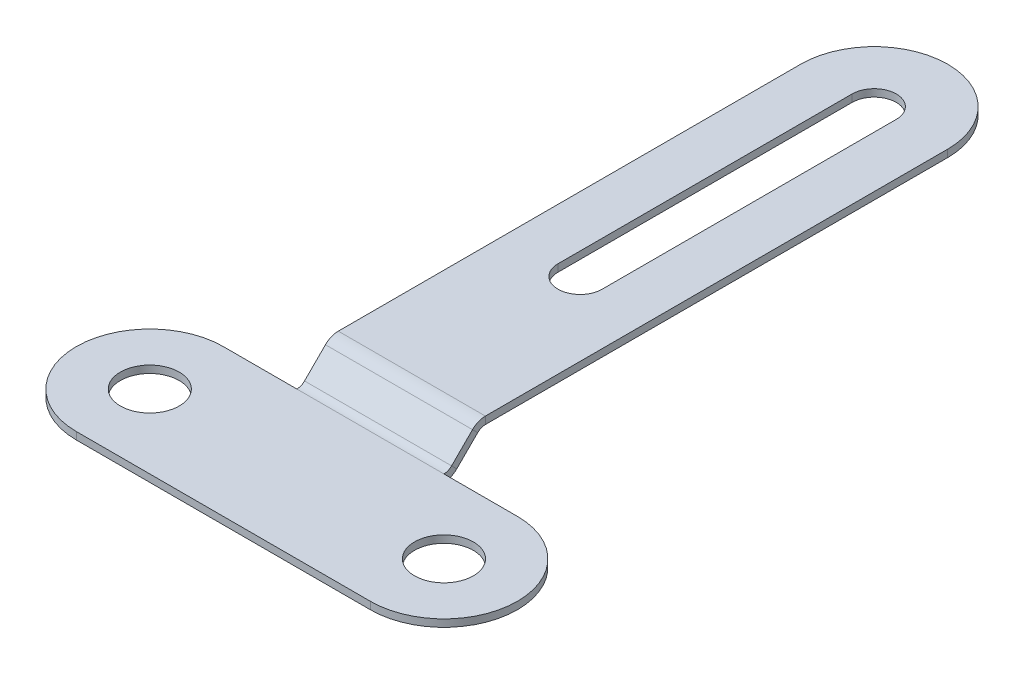
ISO-10303-21;
HEADER;
FILE_DESCRIPTION(('STEP AP214'),'2;1');
FILE_NAME('part.step','',(''),(''),'','','');
FILE_SCHEMA(('AUTOMOTIVE_DESIGN { 1 0 10303 214 1 1 1 1 }'));
ENDSEC;
DATA;
#1=APPLICATION_CONTEXT('core data for automotive mechanical design processes');
#2=APPLICATION_PROTOCOL_DEFINITION('international standard','automotive_design',2000,#1);
#3=PRODUCT_CONTEXT('',#1,'mechanical');
#4=PRODUCT('Part','Part','',(#3));
#5=PRODUCT_RELATED_PRODUCT_CATEGORY('part','',(#4));
#6=PRODUCT_DEFINITION_FORMATION('','',#4);
#7=PRODUCT_DEFINITION_CONTEXT('part definition',#1,'design');
#8=PRODUCT_DEFINITION('design','',#6,#7);
#9=PRODUCT_DEFINITION_SHAPE('','',#8);
#10=(LENGTH_UNIT() NAMED_UNIT(*) SI_UNIT(.MILLI.,.METRE.));
#11=(NAMED_UNIT(*) PLANE_ANGLE_UNIT() SI_UNIT($,.RADIAN.));
#12=(NAMED_UNIT(*) SI_UNIT($,.STERADIAN.) SOLID_ANGLE_UNIT());
#13=UNCERTAINTY_MEASURE_WITH_UNIT(LENGTH_MEASURE(1.E-05),#10,'distance_accuracy_value','');
#14=(GEOMETRIC_REPRESENTATION_CONTEXT(3) GLOBAL_UNCERTAINTY_ASSIGNED_CONTEXT((#13)) GLOBAL_UNIT_ASSIGNED_CONTEXT((#10,
#11,#12)) REPRESENTATION_CONTEXT('',''));
#15=CARTESIAN_POINT('',(0.,0.,0.));
#16=DIRECTION('',(0.,0.,1.));
#17=DIRECTION('',(1.,0.,0.));
#18=AXIS2_PLACEMENT_3D('',#15,#16,#17);
#19=CARTESIAN_POINT('',(-10.,-3.86770729930314,-1.4374024107409));
#20=DIRECTION('',(0.,0.707106781186546,0.707106781186549));
#21=DIRECTION('',(0.,-0.707106781186549,0.707106781186546));
#22=AXIS2_PLACEMENT_3D('',#19,#20,#21);
#23=PLANE('',#22);
#24=DIRECTION('',(0.,0.707106781186549,-0.707106781186546));
#25=VECTOR('',#24,1.);
#26=CARTESIAN_POINT('',(5.,-0.332173393370393,-4.97293631667363));
#27=LINE('',#26,#25);
#28=CARTESIAN_POINT('',(5.,0.21574514497799,-5.52085485502201));
#29=VERTEX_POINT('',#28);
#30=CARTESIAN_POINT('',(5.,1.63780824561529,-6.9429179556593));
#31=VERTEX_POINT('',#30);
#32=EDGE_CURVE('E225',#29,#31,#27,.T.);
#33=ORIENTED_EDGE('',*,*,#32,.T.);
#34=DIRECTION('',(-1.,0.,0.));
#35=VECTOR('',#34,1.);
#36=CARTESIAN_POINT('',(-10.,1.63780824561529,-6.9429179556593));
#37=LINE('',#36,#35);
#38=CARTESIAN_POINT('',(-5.,1.63780824561529,-6.9429179556593));
#39=VERTEX_POINT('',#38);
#40=EDGE_CURVE('E49',#31,#39,#37,.T.);
#41=ORIENTED_EDGE('',*,*,#40,.T.);
#42=DIRECTION('',(0.,-0.707106781186549,0.707106781186546));
#43=VECTOR('',#42,1.);
#44=CARTESIAN_POINT('',(-5.,-0.332173393370393,-4.97293631667363));
#45=LINE('',#44,#43);
#46=CARTESIAN_POINT('',(-5.,0.21574514497799,-5.52085485502201));
#47=VERTEX_POINT('',#46);
#48=EDGE_CURVE('E302',#39,#47,#45,.T.);
#49=ORIENTED_EDGE('',*,*,#48,.T.);
#50=DIRECTION('',(-1.,0.,0.));
#51=VECTOR('',#50,1.);
#52=CARTESIAN_POINT('',(-10.,0.21574514497799,-5.52085485502201));
#53=LINE('',#52,#51);
#54=EDGE_CURVE('E288',#29,#47,#53,.T.);
#55=ORIENTED_EDGE('',*,*,#54,.F.);
#56=EDGE_LOOP('',(#33,#41,#49,#55));
#57=FACE_BOUND('',#56,.T.);
#58=ADVANCED_FACE('F40',(#57),#23,.T.);
#59=CARTESIAN_POINT('',(5.,-0.685726783963666,-5.3264897072669));
#60=DIRECTION('',(1.,0.,0.));
#61=DIRECTION('',(0.,0.707106781186549,-0.707106781186546));
#62=AXIS2_PLACEMENT_3D('',#59,#60,#61);
#63=PLANE('',#62);
#64=DIRECTION('',(0.,0.707106781186549,-0.707106781186546));
#65=VECTOR('',#64,1.);
#66=CARTESIAN_POINT('',(5.,-0.685726783963666,-5.3264897072669));
#67=LINE('',#66,#65);
#68=CARTESIAN_POINT('',(5.,-0.137808245615283,-5.87440824561529));
#69=VERTEX_POINT('',#68);
#70=CARTESIAN_POINT('',(5.,1.28425485502202,-7.29647134625258));
#71=VERTEX_POINT('',#70);
#72=EDGE_CURVE('E299',#69,#71,#67,.T.);
#73=ORIENTED_EDGE('',*,*,#72,.T.);
#74=DIRECTION('',(0.,0.707106781186546,0.707106781186549));
#75=VECTOR('',#74,1.);
#76=CARTESIAN_POINT('',(5.,1.28425485502202,-7.29647134625258));
#77=LINE('',#76,#75);
#78=EDGE_CURVE('E12',#71,#31,#77,.T.);
#79=ORIENTED_EDGE('',*,*,#78,.T.);
#80=ORIENTED_EDGE('',*,*,#32,.F.);
#81=DIRECTION('',(0.,0.707106781186546,0.707106781186549));
#82=VECTOR('',#81,1.);
#83=CARTESIAN_POINT('',(5.,-0.137808245615283,-5.87440824561529));
#84=LINE('',#83,#82);
#85=EDGE_CURVE('E286',#69,#29,#84,.T.);
#86=ORIENTED_EDGE('',*,*,#85,.F.);
#87=EDGE_LOOP('',(#73,#79,#80,#86));
#88=FACE_BOUND('',#87,.T.);
#89=ADVANCED_FACE('F42',(#88),#63,.T.);
#90=CARTESIAN_POINT('',(-5.,-0.685726783963666,-5.3264897072669));
#91=DIRECTION('',(-1.,0.,0.));
#92=DIRECTION('',(0.,-0.707106781186549,0.707106781186546));
#93=AXIS2_PLACEMENT_3D('',#90,#91,#92);
#94=PLANE('',#93);
#95=ORIENTED_EDGE('',*,*,#48,.F.);
#96=DIRECTION('',(0.,-0.707106781186546,-0.707106781186549));
#97=VECTOR('',#96,1.);
#98=CARTESIAN_POINT('',(-5.,1.28425485502202,-7.29647134625258));
#99=LINE('',#98,#97);
#100=CARTESIAN_POINT('',(-5.,1.28425485502202,-7.29647134625258));
#101=VERTEX_POINT('',#100);
#102=EDGE_CURVE('E294',#39,#101,#99,.T.);
#103=ORIENTED_EDGE('',*,*,#102,.T.);
#104=DIRECTION('',(0.,-0.707106781186549,0.707106781186546));
#105=VECTOR('',#104,1.);
#106=CARTESIAN_POINT('',(-5.,-0.685726783963666,-5.3264897072669));
#107=LINE('',#106,#105);
#108=CARTESIAN_POINT('',(-5.,-0.137808245615283,-5.87440824561529));
#109=VERTEX_POINT('',#108);
#110=EDGE_CURVE('E44',#101,#109,#107,.T.);
#111=ORIENTED_EDGE('',*,*,#110,.T.);
#112=DIRECTION('',(0.,-0.707106781186546,-0.707106781186549));
#113=VECTOR('',#112,1.);
#114=CARTESIAN_POINT('',(-5.,-0.137808245615283,-5.87440824561529));
#115=LINE('',#114,#113);
#116=EDGE_CURVE('E290',#47,#109,#115,.T.);
#117=ORIENTED_EDGE('',*,*,#116,.F.);
#118=EDGE_LOOP('',(#95,#103,#111,#117));
#119=FACE_BOUND('',#118,.T.);
#120=ADVANCED_FACE('F325',(#119),#94,.T.);
#121=CARTESIAN_POINT('',(-10.,-4.22126068989641,-1.79095580133417));
#122=DIRECTION('',(0.,0.707106781186546,0.707106781186549));
#123=DIRECTION('',(0.,-0.707106781186549,0.707106781186546));
#124=AXIS2_PLACEMENT_3D('',#121,#122,#123);
#125=PLANE('',#124);
#126=DIRECTION('',(-1.,0.,0.));
#127=VECTOR('',#126,1.);
#128=CARTESIAN_POINT('',(-10.,1.28425485502202,-7.29647134625258));
#129=LINE('',#128,#127);
#130=EDGE_CURVE('E292',#71,#101,#129,.T.);
#131=ORIENTED_EDGE('',*,*,#130,.F.);
#132=ORIENTED_EDGE('',*,*,#72,.F.);
#133=DIRECTION('',(-1.,0.,0.));
#134=VECTOR('',#133,1.);
#135=CARTESIAN_POINT('',(-10.,-0.137808245615283,-5.87440824561529));
#136=LINE('',#135,#134);
#137=EDGE_CURVE('E283',#69,#109,#136,.T.);
#138=ORIENTED_EDGE('',*,*,#137,.T.);
#139=ORIENTED_EDGE('',*,*,#110,.F.);
#140=EDGE_LOOP('',(#131,#132,#138,#139));
#141=FACE_BOUND('',#140,.T.);
#142=ADVANCED_FACE('F320',(#141),#125,.F.);
#143=CARTESIAN_POINT('',(-10.,-0.501,0.));
#144=DIRECTION('',(0.,1.,0.));
#145=DIRECTION('',(0.,0.,1.));
#146=AXIS2_PLACEMENT_3D('',#143,#144,#145);
#147=CYLINDRICAL_SURFACE('',#146,2.);
#148=CARTESIAN_POINT('',(-10.,0.,0.));
#149=DIRECTION('',(0.,1.,0.));
#150=DIRECTION('',(0.,0.,1.));
#151=AXIS2_PLACEMENT_3D('',#148,#149,#150);
#152=CIRCLE('',#151,2.);
#153=CARTESIAN_POINT('',(-10.,0.,2.));
#154=VERTEX_POINT('',#153);
#155=EDGE_CURVE('E277',#154,#154,#152,.T.);
#156=ORIENTED_EDGE('',*,*,#155,.T.);
#157=EDGE_LOOP('',(#156));
#158=FACE_BOUND('',#157,.T.);
#159=CARTESIAN_POINT('',(-10.,-0.5,0.));
#160=DIRECTION('',(0.,1.,0.));
#161=DIRECTION('',(0.,0.,1.));
#162=AXIS2_PLACEMENT_3D('',#159,#160,#161);
#163=CIRCLE('',#162,2.);
#164=CARTESIAN_POINT('',(-10.,-0.5,2.));
#165=VERTEX_POINT('',#164);
#166=EDGE_CURVE('E274',#165,#165,#163,.F.);
#167=ORIENTED_EDGE('',*,*,#166,.T.);
#168=EDGE_LOOP('',(#167));
#169=FACE_BOUND('',#168,.T.);
#170=ADVANCED_FACE('F409',(#158,#169),#147,.F.);
#171=CARTESIAN_POINT('',(10.,-0.501,0.));
#172=DIRECTION('',(0.,1.,0.));
#173=DIRECTION('',(0.,0.,1.));
#174=AXIS2_PLACEMENT_3D('',#171,#172,#173);
#175=CYLINDRICAL_SURFACE('',#174,2.);
#176=CARTESIAN_POINT('',(10.,0.,0.));
#177=DIRECTION('',(0.,1.,0.));
#178=DIRECTION('',(0.,0.,1.));
#179=AXIS2_PLACEMENT_3D('',#176,#177,#178);
#180=CIRCLE('',#179,2.);
#181=CARTESIAN_POINT('',(10.,0.,2.));
#182=VERTEX_POINT('',#181);
#183=EDGE_CURVE('E271',#182,#182,#180,.T.);
#184=ORIENTED_EDGE('',*,*,#183,.T.);
#185=EDGE_LOOP('',(#184));
#186=FACE_BOUND('',#185,.T.);
#187=CARTESIAN_POINT('',(10.,-0.5,0.));
#188=DIRECTION('',(0.,1.,0.));
#189=DIRECTION('',(0.,0.,1.));
#190=AXIS2_PLACEMENT_3D('',#187,#188,#189);
#191=CIRCLE('',#190,2.);
#192=CARTESIAN_POINT('',(10.,-0.5,2.));
#193=VERTEX_POINT('',#192);
#194=EDGE_CURVE('E268',#193,#193,#191,.F.);
#195=ORIENTED_EDGE('',*,*,#194,.T.);
#196=EDGE_LOOP('',(#195));
#197=FACE_BOUND('',#196,.T.);
#198=ADVANCED_FACE('F438',(#186,#197),#175,.F.);
#199=CARTESIAN_POINT('',(-10.,-0.5,0.));
#200=DIRECTION('',(0.,1.,0.));
#201=DIRECTION('',(0.,0.,1.));
#202=AXIS2_PLACEMENT_3D('',#199,#200,#201);
#203=CYLINDRICAL_SURFACE('',#202,5.);
#204=CARTESIAN_POINT('',(-10.,0.,0.));
#205=DIRECTION('',(0.,1.,0.));
#206=DIRECTION('',(0.,0.,1.));
#207=AXIS2_PLACEMENT_3D('',#204,#205,#206);
#208=CIRCLE('',#207,5.);
#209=CARTESIAN_POINT('',(-10.,0.,-5.));
#210=VERTEX_POINT('',#209);
#211=CARTESIAN_POINT('',(-10.,0.,5.));
#212=VERTEX_POINT('',#211);
#213=EDGE_CURVE('E235',#210,#212,#208,.T.);
#214=ORIENTED_EDGE('',*,*,#213,.F.);
#215=DIRECTION('',(0.,1.,0.));
#216=VECTOR('',#215,1.);
#217=CARTESIAN_POINT('',(-10.,-0.5,-5.));
#218=LINE('',#217,#216);
#219=CARTESIAN_POINT('',(-10.,-0.5,-5.));
#220=VERTEX_POINT('',#219);
#221=EDGE_CURVE('E223',#220,#210,#218,.T.);
#222=ORIENTED_EDGE('',*,*,#221,.F.);
#223=CARTESIAN_POINT('',(-10.,-0.5,0.));
#224=DIRECTION('',(0.,1.,0.));
#225=DIRECTION('',(0.,0.,1.));
#226=AXIS2_PLACEMENT_3D('',#223,#224,#225);
#227=CIRCLE('',#226,5.);
#228=CARTESIAN_POINT('',(-10.,-0.5,5.));
#229=VERTEX_POINT('',#228);
#230=EDGE_CURVE('E265',#220,#229,#227,.T.);
#231=ORIENTED_EDGE('',*,*,#230,.T.);
#232=DIRECTION('',(0.,1.,0.));
#233=VECTOR('',#232,1.);
#234=CARTESIAN_POINT('',(-10.,-0.5,5.));
#235=LINE('',#234,#233);
#236=EDGE_CURVE('E263',#229,#212,#235,.T.);
#237=ORIENTED_EDGE('',*,*,#236,.T.);
#238=EDGE_LOOP('',(#214,#222,#231,#237));
#239=FACE_BOUND('',#238,.T.);
#240=ADVANCED_FACE('F434',(#239),#203,.T.);
#241=CARTESIAN_POINT('',(-10.,-0.5,5.));
#242=DIRECTION('',(0.,0.,1.));
#243=DIRECTION('',(1.,0.,0.));
#244=AXIS2_PLACEMENT_3D('',#241,#242,#243);
#245=PLANE('',#244);
#246=DIRECTION('',(1.,0.,0.));
#247=VECTOR('',#246,1.);
#248=CARTESIAN_POINT('',(-10.,0.,5.));
#249=LINE('',#248,#247);
#250=CARTESIAN_POINT('',(10.,0.,5.));
#251=VERTEX_POINT('',#250);
#252=EDGE_CURVE('E232',#212,#251,#249,.T.);
#253=ORIENTED_EDGE('',*,*,#252,.F.);
#254=ORIENTED_EDGE('',*,*,#236,.F.);
#255=DIRECTION('',(1.,0.,0.));
#256=VECTOR('',#255,1.);
#257=CARTESIAN_POINT('',(-10.,-0.5,5.));
#258=LINE('',#257,#256);
#259=CARTESIAN_POINT('',(10.,-0.5,5.));
#260=VERTEX_POINT('',#259);
#261=EDGE_CURVE('E260',#229,#260,#258,.T.);
#262=ORIENTED_EDGE('',*,*,#261,.T.);
#263=DIRECTION('',(0.,1.,0.));
#264=VECTOR('',#263,1.);
#265=CARTESIAN_POINT('',(10.,-0.5,5.));
#266=LINE('',#265,#264);
#267=EDGE_CURVE('E258',#260,#251,#266,.T.);
#268=ORIENTED_EDGE('',*,*,#267,.T.);
#269=EDGE_LOOP('',(#253,#254,#262,#268));
#270=FACE_BOUND('',#269,.T.);
#271=ADVANCED_FACE('F430',(#270),#245,.T.);
#272=CARTESIAN_POINT('',(10.,-0.5,0.));
#273=DIRECTION('',(0.,1.,0.));
#274=DIRECTION('',(0.,0.,1.));
#275=AXIS2_PLACEMENT_3D('',#272,#273,#274);
#276=CYLINDRICAL_SURFACE('',#275,5.);
#277=CARTESIAN_POINT('',(10.,0.,0.));
#278=DIRECTION('',(0.,1.,0.));
#279=DIRECTION('',(0.,0.,1.));
#280=AXIS2_PLACEMENT_3D('',#277,#278,#279);
#281=CIRCLE('',#280,5.);
#282=CARTESIAN_POINT('',(10.,0.,-5.));
#283=VERTEX_POINT('',#282);
#284=EDGE_CURVE('E229',#251,#283,#281,.T.);
#285=ORIENTED_EDGE('',*,*,#284,.F.);
#286=ORIENTED_EDGE('',*,*,#267,.F.);
#287=CARTESIAN_POINT('',(10.,-0.5,0.));
#288=DIRECTION('',(0.,1.,0.));
#289=DIRECTION('',(0.,0.,1.));
#290=AXIS2_PLACEMENT_3D('',#287,#288,#289);
#291=CIRCLE('',#290,5.);
#292=CARTESIAN_POINT('',(10.,-0.5,-5.));
#293=VERTEX_POINT('',#292);
#294=EDGE_CURVE('E255',#260,#293,#291,.T.);
#295=ORIENTED_EDGE('',*,*,#294,.T.);
#296=DIRECTION('',(0.,1.,0.));
#297=VECTOR('',#296,1.);
#298=CARTESIAN_POINT('',(10.,-0.5,-5.));
#299=LINE('',#298,#297);
#300=EDGE_CURVE('E253',#293,#283,#299,.T.);
#301=ORIENTED_EDGE('',*,*,#300,.T.);
#302=EDGE_LOOP('',(#285,#286,#295,#301));
#303=FACE_BOUND('',#302,.T.);
#304=ADVANCED_FACE('F426',(#303),#276,.T.);
#305=CARTESIAN_POINT('',(-10.,-0.5,0.));
#306=DIRECTION('',(0.,1.,0.));
#307=DIRECTION('',(0.,0.,1.));
#308=AXIS2_PLACEMENT_3D('',#305,#306,#307);
#309=PLANE('',#308);
#310=DIRECTION('',(-1.,0.,0.));
#311=VECTOR('',#310,1.);
#312=CARTESIAN_POINT('',(-10.,-0.5,-5.));
#313=LINE('',#312,#311);
#314=CARTESIAN_POINT('',(5.,-0.5,-5.));
#315=VERTEX_POINT('',#314);
#316=CARTESIAN_POINT('',(-5.,-0.5,-5.));
#317=VERTEX_POINT('',#316);
#318=EDGE_CURVE('E219',#315,#317,#313,.T.);
#319=ORIENTED_EDGE('',*,*,#318,.F.);
#320=DIRECTION('',(-1.,0.,0.));
#321=VECTOR('',#320,1.);
#322=CARTESIAN_POINT('',(5.,-0.5,-5.));
#323=LINE('',#322,#321);
#324=EDGE_CURVE('E250',#293,#315,#323,.T.);
#325=ORIENTED_EDGE('',*,*,#324,.F.);
#326=ORIENTED_EDGE('',*,*,#294,.F.);
#327=ORIENTED_EDGE('',*,*,#261,.F.);
#328=ORIENTED_EDGE('',*,*,#230,.F.);
#329=DIRECTION('',(-1.,0.,0.));
#330=VECTOR('',#329,1.);
#331=CARTESIAN_POINT('',(-10.,-0.5,-5.));
#332=LINE('',#331,#330);
#333=EDGE_CURVE('E226',#317,#220,#332,.T.);
#334=ORIENTED_EDGE('',*,*,#333,.F.);
#335=EDGE_LOOP('',(#319,#325,#326,#327,#328,#334));
#336=FACE_BOUND('',#335,.T.);
#337=ORIENTED_EDGE('',*,*,#194,.F.);
#338=EDGE_LOOP('',(#337));
#339=FACE_BOUND('',#338,.T.);
#340=ORIENTED_EDGE('',*,*,#166,.F.);
#341=EDGE_LOOP('',(#340));
#342=FACE_BOUND('',#341,.T.);
#343=ADVANCED_FACE('F422',(#336,#339,#342),#309,.F.);
#344=CARTESIAN_POINT('',(5.,-0.5,-5.));
#345=DIRECTION('',(0.,0.,-1.));
#346=DIRECTION('',(-1.,0.,0.));
#347=AXIS2_PLACEMENT_3D('',#344,#345,#346);
#348=PLANE('',#347);
#349=DIRECTION('',(-1.,0.,0.));
#350=VECTOR('',#349,1.);
#351=CARTESIAN_POINT('',(5.,0.,-5.));
#352=LINE('',#351,#350);
#353=CARTESIAN_POINT('',(5.,0.,-5.));
#354=VERTEX_POINT('',#353);
#355=EDGE_CURVE('E244',#283,#354,#352,.T.);
#356=ORIENTED_EDGE('',*,*,#355,.F.);
#357=ORIENTED_EDGE('',*,*,#300,.F.);
#358=ORIENTED_EDGE('',*,*,#324,.T.);
#359=DIRECTION('',(0.,1.,0.));
#360=VECTOR('',#359,1.);
#361=CARTESIAN_POINT('',(5.,-0.5,-5.));
#362=LINE('',#361,#360);
#363=EDGE_CURVE('E247',#315,#354,#362,.T.);
#364=ORIENTED_EDGE('',*,*,#363,.T.);
#365=EDGE_LOOP('',(#356,#357,#358,#364));
#366=FACE_BOUND('',#365,.T.);
#367=ADVANCED_FACE('F418',(#366),#348,.T.);
#368=CARTESIAN_POINT('',(-10.,0.,0.));
#369=DIRECTION('',(0.,1.,0.));
#370=DIRECTION('',(0.,0.,1.));
#371=AXIS2_PLACEMENT_3D('',#368,#369,#370);
#372=PLANE('',#371);
#373=ORIENTED_EDGE('',*,*,#155,.F.);
#374=EDGE_LOOP('',(#373));
#375=FACE_BOUND('',#374,.T.);
#376=ORIENTED_EDGE('',*,*,#183,.F.);
#377=EDGE_LOOP('',(#376));
#378=FACE_BOUND('',#377,.T.);
#379=ORIENTED_EDGE('',*,*,#355,.T.);
#380=DIRECTION('',(-1.,0.,0.));
#381=VECTOR('',#380,1.);
#382=CARTESIAN_POINT('',(-10.,0.,-5.));
#383=LINE('',#382,#381);
#384=CARTESIAN_POINT('',(-5.,0.,-5.));
#385=VERTEX_POINT('',#384);
#386=EDGE_CURVE('E241',#354,#385,#383,.T.);
#387=ORIENTED_EDGE('',*,*,#386,.T.);
#388=DIRECTION('',(-1.,0.,0.));
#389=VECTOR('',#388,1.);
#390=CARTESIAN_POINT('',(-10.,0.,-5.));
#391=LINE('',#390,#389);
#392=EDGE_CURVE('E238',#385,#210,#391,.T.);
#393=ORIENTED_EDGE('',*,*,#392,.T.);
#394=ORIENTED_EDGE('',*,*,#213,.T.);
#395=ORIENTED_EDGE('',*,*,#252,.T.);
#396=ORIENTED_EDGE('',*,*,#284,.T.);
#397=EDGE_LOOP('',(#379,#387,#393,#394,#395,#396));
#398=FACE_BOUND('',#397,.T.);
#399=ADVANCED_FACE('F414',(#375,#378,#398),#372,.T.);
#400=CARTESIAN_POINT('',(-10.,-0.5,-5.));
#401=DIRECTION('',(0.,0.,-1.));
#402=DIRECTION('',(-1.,0.,0.));
#403=AXIS2_PLACEMENT_3D('',#400,#401,#402);
#404=PLANE('',#403);
#405=ORIENTED_EDGE('',*,*,#392,.F.);
#406=DIRECTION('',(0.,1.,0.));
#407=VECTOR('',#406,1.);
#408=CARTESIAN_POINT('',(-5.,-0.5,-5.));
#409=LINE('',#408,#407);
#410=EDGE_CURVE('E280',#317,#385,#409,.T.);
#411=ORIENTED_EDGE('',*,*,#410,.F.);
#412=ORIENTED_EDGE('',*,*,#333,.T.);
#413=ORIENTED_EDGE('',*,*,#221,.T.);
#414=EDGE_LOOP('',(#405,#411,#412,#413));
#415=FACE_BOUND('',#414,.T.);
#416=ADVANCED_FACE('F410',(#415),#404,.T.);
#417=CARTESIAN_POINT('',(5.,0.7366,-5.));
#418=DIRECTION('',(1.,0.,0.));
#419=DIRECTION('',(0.,0.,-1.));
#420=AXIS2_PLACEMENT_3D('',#417,#418,#419);
#421=PLANE('',#420);
#422=ORIENTED_EDGE('',*,*,#85,.T.);
#423=CARTESIAN_POINT('',(5.,0.7366,-5.));
#424=DIRECTION('',(1.,0.,0.));
#425=DIRECTION('',(0.,0.,-1.));
#426=AXIS2_PLACEMENT_3D('',#423,#424,#425);
#427=CIRCLE('',#426,0.7366);
#428=EDGE_CURVE('E210',#29,#354,#427,.F.);
#429=ORIENTED_EDGE('',*,*,#428,.T.);
#430=ORIENTED_EDGE('',*,*,#363,.F.);
#431=CARTESIAN_POINT('',(5.,0.7366,-5.));
#432=DIRECTION('',(-1.,0.,0.));
#433=DIRECTION('',(0.,0.,-1.));
#434=AXIS2_PLACEMENT_3D('',#431,#432,#433);
#435=CIRCLE('',#434,1.2366);
#436=EDGE_CURVE('E214',#69,#315,#435,.T.);
#437=ORIENTED_EDGE('',*,*,#436,.F.);
#438=EDGE_LOOP('',(#422,#429,#430,#437));
#439=FACE_BOUND('',#438,.T.);
#440=ADVANCED_FACE('F413',(#439),#421,.T.);
#441=CARTESIAN_POINT('',(-5.,0.7366,-5.));
#442=DIRECTION('',(-1.,0.,0.));
#443=DIRECTION('',(0.,0.,1.));
#444=AXIS2_PLACEMENT_3D('',#441,#442,#443);
#445=PLANE('',#444);
#446=CARTESIAN_POINT('',(-5.,0.7366,-5.));
#447=DIRECTION('',(1.,0.,0.));
#448=DIRECTION('',(0.,0.,-1.));
#449=AXIS2_PLACEMENT_3D('',#446,#447,#448);
#450=CIRCLE('',#449,0.7366);
#451=EDGE_CURVE('E217',#385,#47,#450,.T.);
#452=ORIENTED_EDGE('',*,*,#451,.T.);
#453=ORIENTED_EDGE('',*,*,#116,.T.);
#454=CARTESIAN_POINT('',(-5.,0.7366,-5.));
#455=DIRECTION('',(1.,0.,0.));
#456=DIRECTION('',(0.,0.,1.));
#457=AXIS2_PLACEMENT_3D('',#454,#455,#456);
#458=CIRCLE('',#457,1.2366);
#459=EDGE_CURVE('E65',#317,#109,#458,.T.);
#460=ORIENTED_EDGE('',*,*,#459,.F.);
#461=ORIENTED_EDGE('',*,*,#410,.T.);
#462=EDGE_LOOP('',(#452,#453,#460,#461));
#463=FACE_BOUND('',#462,.T.);
#464=ADVANCED_FACE('F446',(#463),#445,.T.);
#465=CARTESIAN_POINT('',(-10.0424314510646,0.7366,-5.));
#466=DIRECTION('',(1.,0.,0.));
#467=DIRECTION('',(0.,0.,-1.));
#468=AXIS2_PLACEMENT_3D('',#465,#466,#467);
#469=CYLINDRICAL_SURFACE('',#468,1.2366);
#470=ORIENTED_EDGE('',*,*,#318,.T.);
#471=ORIENTED_EDGE('',*,*,#459,.T.);
#472=ORIENTED_EDGE('',*,*,#137,.F.);
#473=ORIENTED_EDGE('',*,*,#436,.T.);
#474=EDGE_LOOP('',(#470,#471,#472,#473));
#475=FACE_BOUND('',#474,.T.);
#476=ADVANCED_FACE('F449',(#475),#469,.T.);
#477=CARTESIAN_POINT('',(-10.0424314510646,0.7366,-5.));
#478=DIRECTION('',(1.,0.,0.));
#479=DIRECTION('',(0.,0.,-1.));
#480=AXIS2_PLACEMENT_3D('',#477,#478,#479);
#481=CYLINDRICAL_SURFACE('',#480,0.7366);
#482=ORIENTED_EDGE('',*,*,#386,.F.);
#483=ORIENTED_EDGE('',*,*,#428,.F.);
#484=ORIENTED_EDGE('',*,*,#54,.T.);
#485=ORIENTED_EDGE('',*,*,#451,.F.);
#486=EDGE_LOOP('',(#482,#483,#484,#485));
#487=FACE_BOUND('',#486,.T.);
#488=ADVANCED_FACE('F454',(#487),#481,.F.);
#489=CARTESIAN_POINT('',(5.,0.763400000000005,-7.81732620127459));
#490=DIRECTION('',(-1.,0.,0.));
#491=DIRECTION('',(0.,0.,1.));
#492=AXIS2_PLACEMENT_3D('',#489,#490,#491);
#493=PLANE('',#492);
#494=DIRECTION('',(0.,1.,0.));
#495=VECTOR('',#494,1.);
#496=CARTESIAN_POINT('',(5.,1.50000000000001,-7.81732620127459));
#497=LINE('',#496,#495);
#498=CARTESIAN_POINT('',(5.,1.50000000000001,-7.81732620127459));
#499=VERTEX_POINT('',#498);
#500=CARTESIAN_POINT('',(5.,2.00000000000001,-7.81732620127459));
#501=VERTEX_POINT('',#500);
#502=EDGE_CURVE('E173',#499,#501,#497,.T.);
#503=ORIENTED_EDGE('',*,*,#502,.T.);
#504=CARTESIAN_POINT('',(5.,0.763400000000005,-7.81732620127459));
#505=DIRECTION('',(1.,0.,0.));
#506=DIRECTION('',(0.,0.,-1.));
#507=AXIS2_PLACEMENT_3D('',#504,#505,#506);
#508=CIRCLE('',#507,1.2366);
#509=EDGE_CURVE('E57',#501,#31,#508,.T.);
#510=ORIENTED_EDGE('',*,*,#509,.T.);
#511=ORIENTED_EDGE('',*,*,#78,.F.);
#512=CARTESIAN_POINT('',(5.,0.763400000000005,-7.81732620127459));
#513=DIRECTION('',(1.,0.,0.));
#514=DIRECTION('',(0.,0.,1.));
#515=AXIS2_PLACEMENT_3D('',#512,#513,#514);
#516=CIRCLE('',#515,0.7366);
#517=EDGE_CURVE('E203',#499,#71,#516,.T.);
#518=ORIENTED_EDGE('',*,*,#517,.F.);
#519=EDGE_LOOP('',(#503,#510,#511,#518));
#520=FACE_BOUND('',#519,.T.);
#521=ADVANCED_FACE('F312',(#520),#493,.F.);
#522=CARTESIAN_POINT('',(-5.,0.763400000000005,-7.81732620127459));
#523=DIRECTION('',(1.,0.,0.));
#524=DIRECTION('',(0.,0.,-1.));
#525=AXIS2_PLACEMENT_3D('',#522,#523,#524);
#526=PLANE('',#525);
#527=CARTESIAN_POINT('',(-5.,0.763400000000005,-7.81732620127459));
#528=DIRECTION('',(1.,0.,0.));
#529=DIRECTION('',(0.,0.,-1.));
#530=AXIS2_PLACEMENT_3D('',#527,#528,#529);
#531=CIRCLE('',#530,1.2366);
#532=CARTESIAN_POINT('',(-5.,2.00000000000001,-7.81732620127459));
#533=VERTEX_POINT('',#532);
#534=EDGE_CURVE('E207',#39,#533,#531,.F.);
#535=ORIENTED_EDGE('',*,*,#534,.T.);
#536=DIRECTION('',(0.,-1.,0.));
#537=VECTOR('',#536,1.);
#538=CARTESIAN_POINT('',(-5.,1.50000000000001,-7.81732620127459));
#539=LINE('',#538,#537);
#540=CARTESIAN_POINT('',(-5.,1.50000000000001,-7.81732620127459));
#541=VERTEX_POINT('',#540);
#542=EDGE_CURVE('E191',#533,#541,#539,.T.);
#543=ORIENTED_EDGE('',*,*,#542,.T.);
#544=CARTESIAN_POINT('',(-5.,0.763400000000005,-7.81732620127459));
#545=DIRECTION('',(-1.,0.,0.));
#546=DIRECTION('',(0.,0.,-1.));
#547=AXIS2_PLACEMENT_3D('',#544,#545,#546);
#548=CIRCLE('',#547,0.7366);
#549=EDGE_CURVE('E206',#101,#541,#548,.T.);
#550=ORIENTED_EDGE('',*,*,#549,.F.);
#551=ORIENTED_EDGE('',*,*,#102,.F.);
#552=EDGE_LOOP('',(#535,#543,#550,#551));
#553=FACE_BOUND('',#552,.T.);
#554=ADVANCED_FACE('F328',(#553),#526,.F.);
#555=CARTESIAN_POINT('',(-10.0809376189588,0.763400000000005,-7.81732620127459));
#556=DIRECTION('',(1.,0.,0.));
#557=DIRECTION('',(0.,0.,-1.));
#558=AXIS2_PLACEMENT_3D('',#555,#556,#557);
#559=CYLINDRICAL_SURFACE('',#558,0.7366);
#560=ORIENTED_EDGE('',*,*,#130,.T.);
#561=ORIENTED_EDGE('',*,*,#549,.T.);
#562=DIRECTION('',(-1.,0.,0.));
#563=VECTOR('',#562,1.);
#564=CARTESIAN_POINT('',(-10.,1.50000000000001,-7.81732620127459));
#565=LINE('',#564,#563);
#566=EDGE_CURVE('E317',#499,#541,#565,.T.);
#567=ORIENTED_EDGE('',*,*,#566,.F.);
#568=ORIENTED_EDGE('',*,*,#517,.T.);
#569=EDGE_LOOP('',(#560,#561,#567,#568));
#570=FACE_BOUND('',#569,.T.);
#571=ADVANCED_FACE('F315',(#570),#559,.F.);
#572=CARTESIAN_POINT('',(-10.0809376189588,0.763400000000005,-7.81732620127459));
#573=DIRECTION('',(1.,0.,0.));
#574=DIRECTION('',(0.,0.,-1.));
#575=AXIS2_PLACEMENT_3D('',#572,#573,#574);
#576=CYLINDRICAL_SURFACE('',#575,1.2366);
#577=ORIENTED_EDGE('',*,*,#40,.F.);
#578=ORIENTED_EDGE('',*,*,#509,.F.);
#579=DIRECTION('',(-1.,0.,0.));
#580=VECTOR('',#579,1.);
#581=CARTESIAN_POINT('',(-10.,2.00000000000001,-7.81732620127459));
#582=LINE('',#581,#580);
#583=EDGE_CURVE('E196',#501,#533,#582,.T.);
#584=ORIENTED_EDGE('',*,*,#583,.T.);
#585=ORIENTED_EDGE('',*,*,#534,.F.);
#586=EDGE_LOOP('',(#577,#578,#584,#585));
#587=FACE_BOUND('',#586,.T.);
#588=ADVANCED_FACE('F330',(#587),#576,.T.);
#589=CARTESIAN_POINT('',(0.,1.50000000000001,-39.2564776217872));
#590=DIRECTION('',(0.,1.,0.));
#591=DIRECTION('',(0.,0.,1.));
#592=AXIS2_PLACEMENT_3D('',#589,#590,#591);
#593=CYLINDRICAL_SURFACE('',#592,5.);
#594=CARTESIAN_POINT('',(0.,2.,-39.2564776217872));
#595=DIRECTION('',(0.,1.,0.));
#596=DIRECTION('',(0.,0.,1.));
#597=AXIS2_PLACEMENT_3D('',#594,#595,#596);
#598=CIRCLE('',#597,5.);
#599=CARTESIAN_POINT('',(5.,2.,-39.2564776217872));
#600=VERTEX_POINT('',#599);
#601=CARTESIAN_POINT('',(-5.,2.,-39.2564776217872));
#602=VERTEX_POINT('',#601);
#603=EDGE_CURVE('E184',#600,#602,#598,.T.);
#604=ORIENTED_EDGE('',*,*,#603,.F.);
#605=DIRECTION('',(0.,1.,0.));
#606=VECTOR('',#605,1.);
#607=CARTESIAN_POINT('',(5.,1.50000000000001,-39.2564776217872));
#608=LINE('',#607,#606);
#609=CARTESIAN_POINT('',(5.,1.50000000000001,-39.2564776217872));
#610=VERTEX_POINT('',#609);
#611=EDGE_CURVE('E171',#610,#600,#608,.T.);
#612=ORIENTED_EDGE('',*,*,#611,.F.);
#613=CARTESIAN_POINT('',(0.,1.50000000000001,-39.2564776217872));
#614=DIRECTION('',(0.,1.,0.));
#615=DIRECTION('',(0.,0.,1.));
#616=AXIS2_PLACEMENT_3D('',#613,#614,#615);
#617=CIRCLE('',#616,5.);
#618=CARTESIAN_POINT('',(-5.,1.50000000000001,-39.2564776217872));
#619=VERTEX_POINT('',#618);
#620=EDGE_CURVE('E182',#610,#619,#617,.T.);
#621=ORIENTED_EDGE('',*,*,#620,.T.);
#622=DIRECTION('',(0.,1.,0.));
#623=VECTOR('',#622,1.);
#624=CARTESIAN_POINT('',(-5.,1.50000000000001,-39.2564776217872));
#625=LINE('',#624,#623);
#626=EDGE_CURVE('E190',#619,#602,#625,.T.);
#627=ORIENTED_EDGE('',*,*,#626,.T.);
#628=EDGE_LOOP('',(#604,#612,#621,#627));
#629=FACE_BOUND('',#628,.T.);
#630=ADVANCED_FACE('F181',(#629),#593,.T.);
#631=CARTESIAN_POINT('',(0.,1.50000000000001,-39.2564776217872));
#632=DIRECTION('',(0.,1.,0.));
#633=DIRECTION('',(0.,0.,1.));
#634=AXIS2_PLACEMENT_3D('',#631,#632,#633);
#635=CYLINDRICAL_SURFACE('',#634,1.5);
#636=CARTESIAN_POINT('',(0.,2.,-39.2564776217872));
#637=DIRECTION('',(0.,1.,0.));
#638=DIRECTION('',(0.,0.,1.));
#639=AXIS2_PLACEMENT_3D('',#636,#637,#638);
#640=CIRCLE('',#639,1.5);
#641=CARTESIAN_POINT('',(1.5,2.,-39.2564776217872));
#642=VERTEX_POINT('',#641);
#643=CARTESIAN_POINT('',(-1.5,2.,-39.2564776217872));
#644=VERTEX_POINT('',#643);
#645=EDGE_CURVE('E193',#642,#644,#640,.T.);
#646=ORIENTED_EDGE('',*,*,#645,.T.);
#647=DIRECTION('',(0.,1.,0.));
#648=VECTOR('',#647,1.);
#649=CARTESIAN_POINT('',(-1.5,1.50000000000001,-39.2564776217872));
#650=LINE('',#649,#648);
#651=CARTESIAN_POINT('',(-1.5,1.50000000000001,-39.2564776217872));
#652=VERTEX_POINT('',#651);
#653=EDGE_CURVE('E358',#652,#644,#650,.T.);
#654=ORIENTED_EDGE('',*,*,#653,.F.);
#655=CARTESIAN_POINT('',(0.,1.50000000000001,-39.2564776217872));
#656=DIRECTION('',(0.,1.,0.));
#657=DIRECTION('',(0.,0.,1.));
#658=AXIS2_PLACEMENT_3D('',#655,#656,#657);
#659=CIRCLE('',#658,1.5);
#660=CARTESIAN_POINT('',(1.5,1.50000000000001,-39.2564776217872));
#661=VERTEX_POINT('',#660);
#662=EDGE_CURVE('E343',#661,#652,#659,.T.);
#663=ORIENTED_EDGE('',*,*,#662,.F.);
#664=DIRECTION('',(0.,1.,0.));
#665=VECTOR('',#664,1.);
#666=CARTESIAN_POINT('',(1.5,1.50000000000001,-39.2564776217872));
#667=LINE('',#666,#665);
#668=EDGE_CURVE('E373',#661,#642,#667,.T.);
#669=ORIENTED_EDGE('',*,*,#668,.T.);
#670=EDGE_LOOP('',(#646,#654,#663,#669));
#671=FACE_BOUND('',#670,.T.);
#672=ADVANCED_FACE('F378',(#671),#635,.F.);
#673=CARTESIAN_POINT('',(1.5,1.50000000000001,-19.2564776217872));
#674=DIRECTION('',(1.,0.,0.));
#675=DIRECTION('',(0.,0.,-1.));
#676=AXIS2_PLACEMENT_3D('',#673,#674,#675);
#677=PLANE('',#676);
#678=DIRECTION('',(0.,0.,-1.));
#679=VECTOR('',#678,1.);
#680=CARTESIAN_POINT('',(1.5,2.00000000000001,-19.2564776217872));
#681=LINE('',#680,#679);
#682=CARTESIAN_POINT('',(1.5,2.00000000000001,-19.2564776217872));
#683=VERTEX_POINT('',#682);
#684=EDGE_CURVE('E370',#683,#642,#681,.T.);
#685=ORIENTED_EDGE('',*,*,#684,.T.);
#686=ORIENTED_EDGE('',*,*,#668,.F.);
#687=DIRECTION('',(0.,0.,-1.));
#688=VECTOR('',#687,1.);
#689=CARTESIAN_POINT('',(1.5,1.50000000000001,-19.2564776217872));
#690=LINE('',#689,#688);
#691=CARTESIAN_POINT('',(1.5,1.50000000000001,-19.2564776217872));
#692=VERTEX_POINT('',#691);
#693=EDGE_CURVE('E349',#692,#661,#690,.T.);
#694=ORIENTED_EDGE('',*,*,#693,.F.);
#695=DIRECTION('',(0.,1.,0.));
#696=VECTOR('',#695,1.);
#697=CARTESIAN_POINT('',(1.5,1.50000000000001,-19.2564776217872));
#698=LINE('',#697,#696);
#699=EDGE_CURVE('E367',#692,#683,#698,.T.);
#700=ORIENTED_EDGE('',*,*,#699,.T.);
#701=EDGE_LOOP('',(#685,#686,#694,#700));
#702=FACE_BOUND('',#701,.T.);
#703=ADVANCED_FACE('F389',(#702),#677,.F.);
#704=CARTESIAN_POINT('',(0.,1.50000000000001,-19.2564776217872));
#705=DIRECTION('',(0.,1.,0.));
#706=DIRECTION('',(0.,0.,1.));
#707=AXIS2_PLACEMENT_3D('',#704,#705,#706);
#708=CYLINDRICAL_SURFACE('',#707,1.5);
#709=CARTESIAN_POINT('',(0.,2.00000000000001,-19.2564776217872));
#710=DIRECTION('',(0.,1.,0.));
#711=DIRECTION('',(0.,0.,1.));
#712=AXIS2_PLACEMENT_3D('',#709,#710,#711);
#713=CIRCLE('',#712,1.5);
#714=CARTESIAN_POINT('',(-1.5,2.00000000000001,-19.2564776217872));
#715=VERTEX_POINT('',#714);
#716=EDGE_CURVE('E365',#715,#683,#713,.T.);
#717=ORIENTED_EDGE('',*,*,#716,.T.);
#718=ORIENTED_EDGE('',*,*,#699,.F.);
#719=CARTESIAN_POINT('',(0.,1.50000000000001,-19.2564776217872));
#720=DIRECTION('',(0.,1.,0.));
#721=DIRECTION('',(0.,0.,1.));
#722=AXIS2_PLACEMENT_3D('',#719,#720,#721);
#723=CIRCLE('',#722,1.5);
#724=CARTESIAN_POINT('',(-1.5,1.50000000000001,-19.2564776217872));
#725=VERTEX_POINT('',#724);
#726=EDGE_CURVE('E352',#725,#692,#723,.T.);
#727=ORIENTED_EDGE('',*,*,#726,.F.);
#728=DIRECTION('',(0.,1.,0.));
#729=VECTOR('',#728,1.);
#730=CARTESIAN_POINT('',(-1.5,1.50000000000001,-19.2564776217872));
#731=LINE('',#730,#729);
#732=EDGE_CURVE('E363',#725,#715,#731,.T.);
#733=ORIENTED_EDGE('',*,*,#732,.T.);
#734=EDGE_LOOP('',(#717,#718,#727,#733));
#735=FACE_BOUND('',#734,.T.);
#736=ADVANCED_FACE('F391',(#735),#708,.F.);
#737=CARTESIAN_POINT('',(-1.5,1.50000000000001,-19.2564776217872));
#738=DIRECTION('',(-1.,0.,0.));
#739=DIRECTION('',(0.,0.,1.));
#740=AXIS2_PLACEMENT_3D('',#737,#738,#739);
#741=PLANE('',#740);
#742=DIRECTION('',(0.,0.,1.));
#743=VECTOR('',#742,1.);
#744=CARTESIAN_POINT('',(-1.5,2.00000000000001,-19.2564776217872));
#745=LINE('',#744,#743);
#746=EDGE_CURVE('E360',#644,#715,#745,.T.);
#747=ORIENTED_EDGE('',*,*,#746,.T.);
#748=ORIENTED_EDGE('',*,*,#732,.F.);
#749=DIRECTION('',(0.,0.,1.));
#750=VECTOR('',#749,1.);
#751=CARTESIAN_POINT('',(-1.5,1.50000000000001,-19.2564776217872));
#752=LINE('',#751,#750);
#753=EDGE_CURVE('E355',#652,#725,#752,.T.);
#754=ORIENTED_EDGE('',*,*,#753,.F.);
#755=ORIENTED_EDGE('',*,*,#653,.T.);
#756=EDGE_LOOP('',(#747,#748,#754,#755));
#757=FACE_BOUND('',#756,.T.);
#758=ADVANCED_FACE('F384',(#757),#741,.F.);
#759=CARTESIAN_POINT('',(-10.,1.5,0.743522378212858));
#760=DIRECTION('',(0.,1.,0.));
#761=DIRECTION('',(0.,0.,1.));
#762=AXIS2_PLACEMENT_3D('',#759,#760,#761);
#763=PLANE('',#762);
#764=ORIENTED_EDGE('',*,*,#753,.T.);
#765=ORIENTED_EDGE('',*,*,#726,.T.);
#766=ORIENTED_EDGE('',*,*,#693,.T.);
#767=ORIENTED_EDGE('',*,*,#662,.T.);
#768=EDGE_LOOP('',(#764,#765,#766,#767));
#769=FACE_BOUND('',#768,.T.);
#770=DIRECTION('',(0.,0.,-1.));
#771=VECTOR('',#770,1.);
#772=CARTESIAN_POINT('',(5.,1.5,-4.25647762178714));
#773=LINE('',#772,#771);
#774=EDGE_CURVE('E168',#499,#610,#773,.T.);
#775=ORIENTED_EDGE('',*,*,#774,.F.);
#776=ORIENTED_EDGE('',*,*,#566,.T.);
#777=DIRECTION('',(0.,0.,1.));
#778=VECTOR('',#777,1.);
#779=CARTESIAN_POINT('',(-5.,1.5,-4.25647762178714));
#780=LINE('',#779,#778);
#781=EDGE_CURVE('E189',#619,#541,#780,.T.);
#782=ORIENTED_EDGE('',*,*,#781,.F.);
#783=ORIENTED_EDGE('',*,*,#620,.F.);
#784=EDGE_LOOP('',(#775,#776,#782,#783));
#785=FACE_BOUND('',#784,.T.);
#786=ADVANCED_FACE('F187',(#769,#785),#763,.F.);
#787=CARTESIAN_POINT('',(-5.,1.5,-4.25647762178714));
#788=DIRECTION('',(-1.,0.,0.));
#789=DIRECTION('',(0.,0.,1.));
#790=AXIS2_PLACEMENT_3D('',#787,#788,#789);
#791=PLANE('',#790);
#792=ORIENTED_EDGE('',*,*,#542,.F.);
#793=DIRECTION('',(0.,0.,1.));
#794=VECTOR('',#793,1.);
#795=CARTESIAN_POINT('',(-5.,2.,-4.25647762178714));
#796=LINE('',#795,#794);
#797=EDGE_CURVE('E177',#602,#533,#796,.T.);
#798=ORIENTED_EDGE('',*,*,#797,.F.);
#799=ORIENTED_EDGE('',*,*,#626,.F.);
#800=ORIENTED_EDGE('',*,*,#781,.T.);
#801=EDGE_LOOP('',(#792,#798,#799,#800));
#802=FACE_BOUND('',#801,.T.);
#803=ADVANCED_FACE('F340',(#802),#791,.T.);
#804=CARTESIAN_POINT('',(-10.,2.00000000000001,0.743522378212858));
#805=DIRECTION('',(0.,1.,0.));
#806=DIRECTION('',(0.,0.,1.));
#807=AXIS2_PLACEMENT_3D('',#804,#805,#806);
#808=PLANE('',#807);
#809=ORIENTED_EDGE('',*,*,#583,.F.);
#810=DIRECTION('',(0.,0.,-1.));
#811=VECTOR('',#810,1.);
#812=CARTESIAN_POINT('',(5.,2.,-4.25647762178714));
#813=LINE('',#812,#811);
#814=EDGE_CURVE('E335',#501,#600,#813,.T.);
#815=ORIENTED_EDGE('',*,*,#814,.T.);
#816=ORIENTED_EDGE('',*,*,#603,.T.);
#817=ORIENTED_EDGE('',*,*,#797,.T.);
#818=EDGE_LOOP('',(#809,#815,#816,#817));
#819=FACE_BOUND('',#818,.T.);
#820=ORIENTED_EDGE('',*,*,#716,.F.);
#821=ORIENTED_EDGE('',*,*,#746,.F.);
#822=ORIENTED_EDGE('',*,*,#645,.F.);
#823=ORIENTED_EDGE('',*,*,#684,.F.);
#824=EDGE_LOOP('',(#820,#821,#822,#823));
#825=FACE_BOUND('',#824,.T.);
#826=ADVANCED_FACE('F333',(#819,#825),#808,.T.);
#827=CARTESIAN_POINT('',(5.,1.5,-4.25647762178714));
#828=DIRECTION('',(1.,0.,0.));
#829=DIRECTION('',(0.,0.,-1.));
#830=AXIS2_PLACEMENT_3D('',#827,#828,#829);
#831=PLANE('',#830);
#832=ORIENTED_EDGE('',*,*,#502,.F.);
#833=ORIENTED_EDGE('',*,*,#774,.T.);
#834=ORIENTED_EDGE('',*,*,#611,.T.);
#835=ORIENTED_EDGE('',*,*,#814,.F.);
#836=EDGE_LOOP('',(#832,#833,#834,#835));
#837=FACE_BOUND('',#836,.T.);
#838=ADVANCED_FACE('F170',(#837),#831,.T.);
#839=CLOSED_SHELL('',(#58,#89,#120,#142,#170,#198,#240,#271,#304,#343,#367,#399,#416,#440,#464,
#476,#488,#521,#554,#571,#588,#630,#672,#703,#736,#758,#786,#803,#826,#838));
#840=MANIFOLD_SOLID_BREP('B2',#839);
#841=ADVANCED_BREP_SHAPE_REPRESENTATION('',(#18,#840),#14);
#842=SHAPE_DEFINITION_REPRESENTATION(#9,#841);
ENDSEC;
END-ISO-10303-21;
